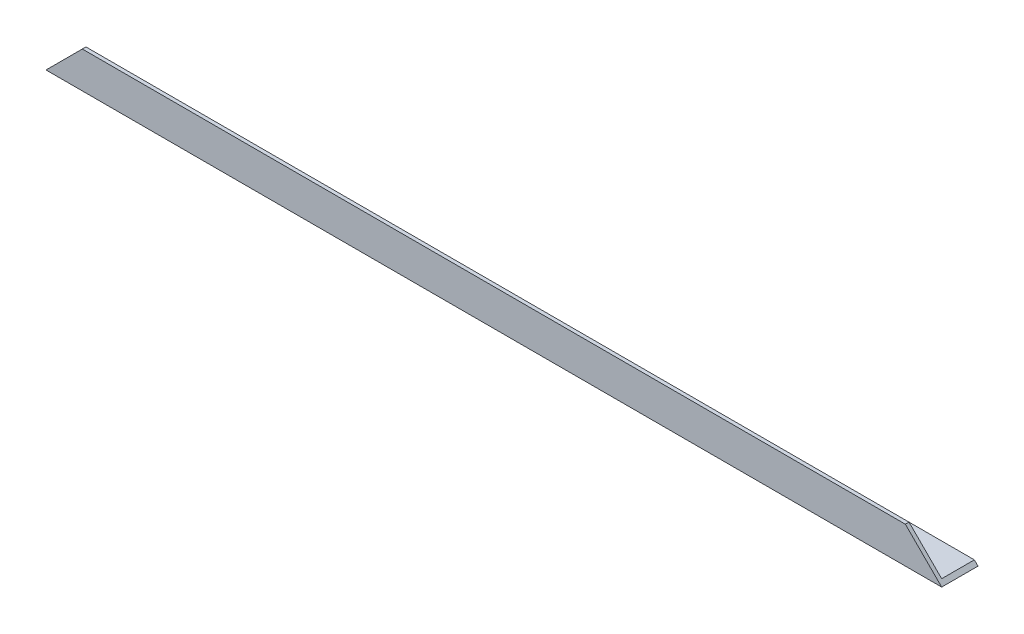
ISO-10303-21;
HEADER;
FILE_DESCRIPTION(('STEP AP214'),'2;1');
FILE_NAME('part.step','',(''),(''),'','','');
FILE_SCHEMA(('AUTOMOTIVE_DESIGN { 1 0 10303 214 1 1 1 1 }'));
ENDSEC;
DATA;
#1=APPLICATION_CONTEXT('core data for automotive mechanical design processes');
#2=APPLICATION_PROTOCOL_DEFINITION('international standard','automotive_design',2000,#1);
#3=PRODUCT_CONTEXT('',#1,'mechanical');
#4=PRODUCT('Part','Part','',(#3));
#5=PRODUCT_RELATED_PRODUCT_CATEGORY('part','',(#4));
#6=PRODUCT_DEFINITION_FORMATION('','',#4);
#7=PRODUCT_DEFINITION_CONTEXT('part definition',#1,'design');
#8=PRODUCT_DEFINITION('design','',#6,#7);
#9=PRODUCT_DEFINITION_SHAPE('','',#8);
#10=(LENGTH_UNIT() NAMED_UNIT(*) SI_UNIT(.MILLI.,.METRE.));
#11=(NAMED_UNIT(*) PLANE_ANGLE_UNIT() SI_UNIT($,.RADIAN.));
#12=(NAMED_UNIT(*) SI_UNIT($,.STERADIAN.) SOLID_ANGLE_UNIT());
#13=UNCERTAINTY_MEASURE_WITH_UNIT(LENGTH_MEASURE(1.E-05),#10,'distance_accuracy_value','');
#14=(GEOMETRIC_REPRESENTATION_CONTEXT(3) GLOBAL_UNCERTAINTY_ASSIGNED_CONTEXT((#13)) GLOBAL_UNIT_ASSIGNED_CONTEXT((#10,
#11,#12)) REPRESENTATION_CONTEXT('',''));
#15=CARTESIAN_POINT('',(0.,0.,0.));
#16=DIRECTION('',(0.,0.,1.));
#17=DIRECTION('',(1.,0.,0.));
#18=AXIS2_PLACEMENT_3D('',#15,#16,#17);
#19=CARTESIAN_POINT('',(370.,1.49999999999998,-15.));
#20=DIRECTION('',(0.,0.,1.));
#21=DIRECTION('',(1.,0.,0.));
#22=AXIS2_PLACEMENT_3D('',#19,#20,#21);
#23=PLANE('',#22);
#24=DIRECTION('',(-0.707106781186546,0.707106781186549,0.));
#25=VECTOR('',#24,1.);
#26=CARTESIAN_POINT('',(370.,0.,-15.));
#27=LINE('',#26,#25);
#28=CARTESIAN_POINT('',(370.,0.,-15.));
#29=VERTEX_POINT('',#28);
#30=CARTESIAN_POINT('',(368.5,1.49999999999998,-15.));
#31=VERTEX_POINT('',#30);
#32=EDGE_CURVE('E83',#29,#31,#27,.T.);
#33=ORIENTED_EDGE('',*,*,#32,.F.);
#34=DIRECTION('',(-1.,0.,0.));
#35=VECTOR('',#34,1.);
#36=CARTESIAN_POINT('',(370.,0.,-15.));
#37=LINE('',#36,#35);
#38=CARTESIAN_POINT('',(0.,0.,-15.));
#39=VERTEX_POINT('',#38);
#40=EDGE_CURVE('E11',#29,#39,#37,.T.);
#41=ORIENTED_EDGE('',*,*,#40,.T.);
#42=DIRECTION('',(0.707106781186546,0.707106781186549,0.));
#43=VECTOR('',#42,1.);
#44=CARTESIAN_POINT('',(0.,0.,-15.));
#45=LINE('',#44,#43);
#46=CARTESIAN_POINT('',(1.49999999999996,1.49999999999998,-15.));
#47=VERTEX_POINT('',#46);
#48=EDGE_CURVE('E119',#39,#47,#45,.T.);
#49=ORIENTED_EDGE('',*,*,#48,.T.);
#50=DIRECTION('',(-1.,0.,0.));
#51=VECTOR('',#50,1.);
#52=CARTESIAN_POINT('',(370.,1.49999999999998,-15.));
#53=LINE('',#52,#51);
#54=EDGE_CURVE('E42',#31,#47,#53,.T.);
#55=ORIENTED_EDGE('',*,*,#54,.F.);
#56=EDGE_LOOP('',(#33,#41,#49,#55));
#57=FACE_BOUND('',#56,.T.);
#58=ADVANCED_FACE('F33',(#57),#23,.F.);
#59=CARTESIAN_POINT('',(370.,1.5,-1.50000000000002));
#60=DIRECTION('',(0.,-1.,0.));
#61=DIRECTION('',(0.,0.,-1.));
#62=AXIS2_PLACEMENT_3D('',#59,#60,#61);
#63=PLANE('',#62);
#64=DIRECTION('',(0.,0.,1.));
#65=VECTOR('',#64,1.);
#66=CARTESIAN_POINT('',(368.5,1.5,-1.50000000000002));
#67=LINE('',#66,#65);
#68=CARTESIAN_POINT('',(368.5,1.5,-1.50000000000002));
#69=VERTEX_POINT('',#68);
#70=EDGE_CURVE('E116',#31,#69,#67,.T.);
#71=ORIENTED_EDGE('',*,*,#70,.F.);
#72=ORIENTED_EDGE('',*,*,#54,.T.);
#73=DIRECTION('',(0.,0.,1.));
#74=VECTOR('',#73,1.);
#75=CARTESIAN_POINT('',(1.5,1.5,-1.49999999999957));
#76=LINE('',#75,#74);
#77=CARTESIAN_POINT('',(1.49999999999997,1.5,-1.50000000000002));
#78=VERTEX_POINT('',#77);
#79=EDGE_CURVE('E100',#47,#78,#76,.T.);
#80=ORIENTED_EDGE('',*,*,#79,.T.);
#81=DIRECTION('',(-1.,0.,0.));
#82=VECTOR('',#81,1.);
#83=CARTESIAN_POINT('',(370.,1.5,-1.50000000000002));
#84=LINE('',#83,#82);
#85=EDGE_CURVE('E111',#69,#78,#84,.T.);
#86=ORIENTED_EDGE('',*,*,#85,.F.);
#87=EDGE_LOOP('',(#71,#72,#80,#86));
#88=FACE_BOUND('',#87,.T.);
#89=ADVANCED_FACE('F114',(#88),#63,.F.);
#90=CARTESIAN_POINT('',(370.,15.,-1.5));
#91=DIRECTION('',(0.,0.,1.));
#92=DIRECTION('',(0.,-1.,0.));
#93=AXIS2_PLACEMENT_3D('',#90,#91,#92);
#94=PLANE('',#93);
#95=DIRECTION('',(-0.707106781186546,0.707106781186549,0.));
#96=VECTOR('',#95,1.);
#97=CARTESIAN_POINT('',(362.5,7.50000000000002,-1.50000000000001));
#98=LINE('',#97,#96);
#99=CARTESIAN_POINT('',(355.,15.,-1.5));
#100=VERTEX_POINT('',#99);
#101=EDGE_CURVE('E135',#69,#100,#98,.T.);
#102=ORIENTED_EDGE('',*,*,#101,.F.);
#103=ORIENTED_EDGE('',*,*,#85,.T.);
#104=DIRECTION('',(0.707106781186546,0.707106781186549,0.));
#105=VECTOR('',#104,1.);
#106=CARTESIAN_POINT('',(192.499999999999,192.5,-1.49999999999971));
#107=LINE('',#106,#105);
#108=CARTESIAN_POINT('',(15.,15.,-1.5));
#109=VERTEX_POINT('',#108);
#110=EDGE_CURVE('E103',#78,#109,#107,.T.);
#111=ORIENTED_EDGE('',*,*,#110,.T.);
#112=DIRECTION('',(-1.,0.,0.));
#113=VECTOR('',#112,1.);
#114=CARTESIAN_POINT('',(370.,15.,-1.5));
#115=LINE('',#114,#113);
#116=EDGE_CURVE('E109',#100,#109,#115,.T.);
#117=ORIENTED_EDGE('',*,*,#116,.F.);
#118=EDGE_LOOP('',(#102,#103,#111,#117));
#119=FACE_BOUND('',#118,.T.);
#120=ADVANCED_FACE('F134',(#119),#94,.F.);
#121=CARTESIAN_POINT('',(370.,15.,0.));
#122=DIRECTION('',(0.,-1.,0.));
#123=DIRECTION('',(0.,0.,-1.));
#124=AXIS2_PLACEMENT_3D('',#121,#122,#123);
#125=PLANE('',#124);
#126=DIRECTION('',(0.,0.,1.));
#127=VECTOR('',#126,1.);
#128=CARTESIAN_POINT('',(355.,15.,0.));
#129=LINE('',#128,#127);
#130=CARTESIAN_POINT('',(355.,15.,0.));
#131=VERTEX_POINT('',#130);
#132=EDGE_CURVE('E95',#100,#131,#129,.T.);
#133=ORIENTED_EDGE('',*,*,#132,.F.);
#134=ORIENTED_EDGE('',*,*,#116,.T.);
#135=DIRECTION('',(0.,0.,1.));
#136=VECTOR('',#135,1.);
#137=CARTESIAN_POINT('',(15.,15.,0.));
#138=LINE('',#137,#136);
#139=CARTESIAN_POINT('',(14.9999999999999,15.,0.));
#140=VERTEX_POINT('',#139);
#141=EDGE_CURVE('E122',#109,#140,#138,.T.);
#142=ORIENTED_EDGE('',*,*,#141,.T.);
#143=DIRECTION('',(-1.,0.,0.));
#144=VECTOR('',#143,1.);
#145=CARTESIAN_POINT('',(370.,15.,0.));
#146=LINE('',#145,#144);
#147=EDGE_CURVE('E107',#131,#140,#146,.T.);
#148=ORIENTED_EDGE('',*,*,#147,.F.);
#149=EDGE_LOOP('',(#133,#134,#142,#148));
#150=FACE_BOUND('',#149,.T.);
#151=ADVANCED_FACE('F143',(#150),#125,.F.);
#152=CARTESIAN_POINT('',(370.,0.,0.));
#153=DIRECTION('',(0.,0.,-1.));
#154=DIRECTION('',(-1.,0.,0.));
#155=AXIS2_PLACEMENT_3D('',#152,#153,#154);
#156=PLANE('',#155);
#157=DIRECTION('',(-0.707106781186546,0.707106781186549,0.));
#158=VECTOR('',#157,1.);
#159=CARTESIAN_POINT('',(370.,0.,0.));
#160=LINE('',#159,#158);
#161=CARTESIAN_POINT('',(370.,0.,0.));
#162=VERTEX_POINT('',#161);
#163=EDGE_CURVE('E48',#162,#131,#160,.T.);
#164=ORIENTED_EDGE('',*,*,#163,.T.);
#165=ORIENTED_EDGE('',*,*,#147,.T.);
#166=DIRECTION('',(0.707106781186546,0.707106781186549,0.));
#167=VECTOR('',#166,1.);
#168=CARTESIAN_POINT('',(0.,0.,0.));
#169=LINE('',#168,#167);
#170=CARTESIAN_POINT('',(0.,0.,0.));
#171=VERTEX_POINT('',#170);
#172=EDGE_CURVE('E123',#171,#140,#169,.T.);
#173=ORIENTED_EDGE('',*,*,#172,.F.);
#174=DIRECTION('',(-1.,0.,0.));
#175=VECTOR('',#174,1.);
#176=CARTESIAN_POINT('',(370.,0.,0.));
#177=LINE('',#176,#175);
#178=EDGE_CURVE('E88',#162,#171,#177,.T.);
#179=ORIENTED_EDGE('',*,*,#178,.F.);
#180=EDGE_LOOP('',(#164,#165,#173,#179));
#181=FACE_BOUND('',#180,.T.);
#182=ADVANCED_FACE('F141',(#181),#156,.F.);
#183=CARTESIAN_POINT('',(370.,0.,-15.));
#184=DIRECTION('',(0.,1.,0.));
#185=DIRECTION('',(0.,0.,1.));
#186=AXIS2_PLACEMENT_3D('',#183,#184,#185);
#187=PLANE('',#186);
#188=DIRECTION('',(0.,0.,-1.));
#189=VECTOR('',#188,1.);
#190=CARTESIAN_POINT('',(0.,0.,-15.));
#191=LINE('',#190,#189);
#192=EDGE_CURVE('E89',#171,#39,#191,.T.);
#193=ORIENTED_EDGE('',*,*,#192,.T.);
#194=ORIENTED_EDGE('',*,*,#40,.F.);
#195=DIRECTION('',(0.,0.,-1.));
#196=VECTOR('',#195,1.);
#197=CARTESIAN_POINT('',(370.,0.,-15.));
#198=LINE('',#197,#196);
#199=EDGE_CURVE('E80',#162,#29,#198,.T.);
#200=ORIENTED_EDGE('',*,*,#199,.F.);
#201=ORIENTED_EDGE('',*,*,#178,.T.);
#202=EDGE_LOOP('',(#193,#194,#200,#201));
#203=FACE_BOUND('',#202,.T.);
#204=ADVANCED_FACE('F35',(#203),#187,.F.);
#205=CARTESIAN_POINT('',(0.,0.,-15.));
#206=DIRECTION('',(0.707106781186549,-0.707106781186546,0.));
#207=DIRECTION('',(0.707106781186546,0.707106781186549,0.));
#208=AXIS2_PLACEMENT_3D('',#205,#206,#207);
#209=PLANE('',#208);
#210=ORIENTED_EDGE('',*,*,#48,.F.);
#211=ORIENTED_EDGE('',*,*,#192,.F.);
#212=ORIENTED_EDGE('',*,*,#172,.T.);
#213=ORIENTED_EDGE('',*,*,#141,.F.);
#214=ORIENTED_EDGE('',*,*,#110,.F.);
#215=ORIENTED_EDGE('',*,*,#79,.F.);
#216=EDGE_LOOP('',(#210,#211,#212,#213,#214,#215));
#217=FACE_BOUND('',#216,.T.);
#218=ADVANCED_FACE('F118',(#217),#209,.F.);
#219=CARTESIAN_POINT('',(370.,0.,-15.));
#220=DIRECTION('',(0.707106781186549,0.707106781186546,0.));
#221=DIRECTION('',(-0.707106781186546,0.707106781186549,0.));
#222=AXIS2_PLACEMENT_3D('',#219,#220,#221);
#223=PLANE('',#222);
#224=ORIENTED_EDGE('',*,*,#70,.T.);
#225=ORIENTED_EDGE('',*,*,#101,.T.);
#226=ORIENTED_EDGE('',*,*,#132,.T.);
#227=ORIENTED_EDGE('',*,*,#163,.F.);
#228=ORIENTED_EDGE('',*,*,#199,.T.);
#229=ORIENTED_EDGE('',*,*,#32,.T.);
#230=EDGE_LOOP('',(#224,#225,#226,#227,#228,#229));
#231=FACE_BOUND('',#230,.T.);
#232=ADVANCED_FACE('F82',(#231),#223,.T.);
#233=CLOSED_SHELL('',(#58,#89,#120,#151,#182,#204,#218,#232));
#234=MANIFOLD_SOLID_BREP('B2',#233);
#235=ADVANCED_BREP_SHAPE_REPRESENTATION('',(#18,#234),#14);
#236=SHAPE_DEFINITION_REPRESENTATION(#9,#235);
ENDSEC;
END-ISO-10303-21;
